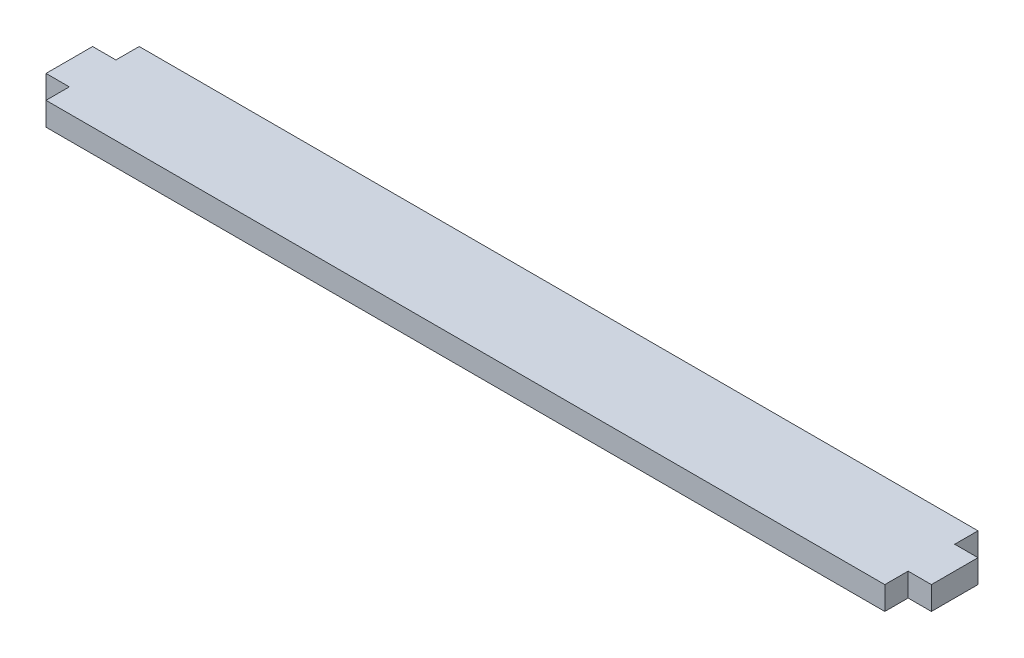
ISO-10303-21;
HEADER;
FILE_DESCRIPTION(('STEP AP214'),'2;1');
FILE_NAME('part.step','',(''),(''),'','','');
FILE_SCHEMA(('AUTOMOTIVE_DESIGN { 1 0 10303 214 1 1 1 1 }'));
ENDSEC;
DATA;
#1=APPLICATION_CONTEXT('core data for automotive mechanical design processes');
#2=APPLICATION_PROTOCOL_DEFINITION('international standard','automotive_design',2000,#1);
#3=PRODUCT_CONTEXT('',#1,'mechanical');
#4=PRODUCT('Part','Part','',(#3));
#5=PRODUCT_RELATED_PRODUCT_CATEGORY('part','',(#4));
#6=PRODUCT_DEFINITION_FORMATION('','',#4);
#7=PRODUCT_DEFINITION_CONTEXT('part definition',#1,'design');
#8=PRODUCT_DEFINITION('design','',#6,#7);
#9=PRODUCT_DEFINITION_SHAPE('','',#8);
#10=(LENGTH_UNIT() NAMED_UNIT(*) SI_UNIT(.MILLI.,.METRE.));
#11=(NAMED_UNIT(*) PLANE_ANGLE_UNIT() SI_UNIT($,.RADIAN.));
#12=(NAMED_UNIT(*) SI_UNIT($,.STERADIAN.) SOLID_ANGLE_UNIT());
#13=UNCERTAINTY_MEASURE_WITH_UNIT(LENGTH_MEASURE(1.E-05),#10,'distance_accuracy_value','');
#14=(GEOMETRIC_REPRESENTATION_CONTEXT(3) GLOBAL_UNCERTAINTY_ASSIGNED_CONTEXT((#13)) GLOBAL_UNIT_ASSIGNED_CONTEXT((#10,
#11,#12)) REPRESENTATION_CONTEXT('',''));
#15=CARTESIAN_POINT('',(0.,0.,0.));
#16=DIRECTION('',(0.,0.,1.));
#17=DIRECTION('',(1.,0.,0.));
#18=AXIS2_PLACEMENT_3D('',#15,#16,#17);
#19=CARTESIAN_POINT('',(0.,3.175,0.));
#20=DIRECTION('',(-1.,0.,0.));
#21=DIRECTION('',(0.,0.,1.));
#22=AXIS2_PLACEMENT_3D('',#19,#20,#21);
#23=PLANE('',#22);
#24=DIRECTION('',(0.,0.,-1.));
#25=VECTOR('',#24,1.);
#26=CARTESIAN_POINT('',(0.,0.,0.));
#27=LINE('',#26,#25);
#28=CARTESIAN_POINT('',(0.,0.,0.));
#29=VERTEX_POINT('',#28);
#30=CARTESIAN_POINT('',(0.,0.,-3.175));
#31=VERTEX_POINT('',#30);
#32=EDGE_CURVE('E152',#29,#31,#27,.T.);
#33=ORIENTED_EDGE('',*,*,#32,.T.);
#34=DIRECTION('',(0.,-1.,0.));
#35=VECTOR('',#34,1.);
#36=CARTESIAN_POINT('',(0.,3.175,-3.175));
#37=LINE('',#36,#35);
#38=CARTESIAN_POINT('',(0.,3.175,-3.175));
#39=VERTEX_POINT('',#38);
#40=EDGE_CURVE('E11',#39,#31,#37,.T.);
#41=ORIENTED_EDGE('',*,*,#40,.F.);
#42=DIRECTION('',(0.,0.,-1.));
#43=VECTOR('',#42,1.);
#44=CARTESIAN_POINT('',(0.,3.175,0.));
#45=LINE('',#44,#43);
#46=CARTESIAN_POINT('',(0.,3.175,0.));
#47=VERTEX_POINT('',#46);
#48=EDGE_CURVE('E174',#47,#39,#45,.T.);
#49=ORIENTED_EDGE('',*,*,#48,.F.);
#50=DIRECTION('',(0.,-1.,0.));
#51=VECTOR('',#50,1.);
#52=CARTESIAN_POINT('',(0.,3.175,0.));
#53=LINE('',#52,#51);
#54=EDGE_CURVE('E148',#47,#29,#53,.T.);
#55=ORIENTED_EDGE('',*,*,#54,.T.);
#56=EDGE_LOOP('',(#33,#41,#49,#55));
#57=FACE_BOUND('',#56,.T.);
#58=ADVANCED_FACE('F32',(#57),#23,.F.);
#59=CARTESIAN_POINT('',(0.,3.175,-3.175));
#60=DIRECTION('',(0.,0.,-1.));
#61=DIRECTION('',(-1.,0.,0.));
#62=AXIS2_PLACEMENT_3D('',#59,#60,#61);
#63=PLANE('',#62);
#64=DIRECTION('',(1.,0.,0.));
#65=VECTOR('',#64,1.);
#66=CARTESIAN_POINT('',(0.,0.,-3.175));
#67=LINE('',#66,#65);
#68=CARTESIAN_POINT('',(3.17500000000003,0.,-3.175));
#69=VERTEX_POINT('',#68);
#70=EDGE_CURVE('E155',#31,#69,#67,.T.);
#71=ORIENTED_EDGE('',*,*,#70,.T.);
#72=DIRECTION('',(0.,-1.,0.));
#73=VECTOR('',#72,1.);
#74=CARTESIAN_POINT('',(3.17500000000003,3.175,-3.175));
#75=LINE('',#74,#73);
#76=CARTESIAN_POINT('',(3.17500000000003,3.175,-3.175));
#77=VERTEX_POINT('',#76);
#78=EDGE_CURVE('E40',#77,#69,#75,.T.);
#79=ORIENTED_EDGE('',*,*,#78,.F.);
#80=DIRECTION('',(1.,0.,0.));
#81=VECTOR('',#80,1.);
#82=CARTESIAN_POINT('',(0.,3.175,-3.175));
#83=LINE('',#82,#81);
#84=EDGE_CURVE('E103',#39,#77,#83,.T.);
#85=ORIENTED_EDGE('',*,*,#84,.F.);
#86=ORIENTED_EDGE('',*,*,#40,.T.);
#87=EDGE_LOOP('',(#71,#79,#85,#86));
#88=FACE_BOUND('',#87,.T.);
#89=ADVANCED_FACE('F252',(#88),#63,.F.);
#90=CARTESIAN_POINT('',(3.17500000000003,3.175,-9.525));
#91=DIRECTION('',(-1.,0.,0.));
#92=DIRECTION('',(0.,0.,1.));
#93=AXIS2_PLACEMENT_3D('',#90,#91,#92);
#94=PLANE('',#93);
#95=DIRECTION('',(0.,0.,-1.));
#96=VECTOR('',#95,1.);
#97=CARTESIAN_POINT('',(3.17500000000003,0.,-9.525));
#98=LINE('',#97,#96);
#99=CARTESIAN_POINT('',(3.17500000000003,0.,-9.525));
#100=VERTEX_POINT('',#99);
#101=EDGE_CURVE('E157',#69,#100,#98,.T.);
#102=ORIENTED_EDGE('',*,*,#101,.T.);
#103=DIRECTION('',(0.,-1.,0.));
#104=VECTOR('',#103,1.);
#105=CARTESIAN_POINT('',(3.17500000000003,3.175,-9.525));
#106=LINE('',#105,#104);
#107=CARTESIAN_POINT('',(3.17500000000003,3.175,-9.525));
#108=VERTEX_POINT('',#107);
#109=EDGE_CURVE('E193',#108,#100,#106,.T.);
#110=ORIENTED_EDGE('',*,*,#109,.F.);
#111=DIRECTION('',(0.,0.,-1.));
#112=VECTOR('',#111,1.);
#113=CARTESIAN_POINT('',(3.17500000000003,3.175,-9.525));
#114=LINE('',#113,#112);
#115=EDGE_CURVE('E201',#77,#108,#114,.T.);
#116=ORIENTED_EDGE('',*,*,#115,.F.);
#117=ORIENTED_EDGE('',*,*,#78,.T.);
#118=EDGE_LOOP('',(#102,#110,#116,#117));
#119=FACE_BOUND('',#118,.T.);
#120=ADVANCED_FACE('F199',(#119),#94,.F.);
#121=CARTESIAN_POINT('',(0.,3.175,-9.525));
#122=DIRECTION('',(0.,0.,1.));
#123=DIRECTION('',(1.,0.,0.));
#124=AXIS2_PLACEMENT_3D('',#121,#122,#123);
#125=PLANE('',#124);
#126=DIRECTION('',(-1.,0.,0.));
#127=VECTOR('',#126,1.);
#128=CARTESIAN_POINT('',(0.,0.,-9.525));
#129=LINE('',#128,#127);
#130=CARTESIAN_POINT('',(0.,0.,-9.525));
#131=VERTEX_POINT('',#130);
#132=EDGE_CURVE('E159',#100,#131,#129,.T.);
#133=ORIENTED_EDGE('',*,*,#132,.T.);
#134=DIRECTION('',(0.,-1.,0.));
#135=VECTOR('',#134,1.);
#136=CARTESIAN_POINT('',(0.,3.175,-9.525));
#137=LINE('',#136,#135);
#138=CARTESIAN_POINT('',(0.,3.175,-9.525));
#139=VERTEX_POINT('',#138);
#140=EDGE_CURVE('E190',#139,#131,#137,.T.);
#141=ORIENTED_EDGE('',*,*,#140,.F.);
#142=DIRECTION('',(-1.,0.,0.));
#143=VECTOR('',#142,1.);
#144=CARTESIAN_POINT('',(0.,3.175,-9.525));
#145=LINE('',#144,#143);
#146=EDGE_CURVE('E219',#108,#139,#145,.T.);
#147=ORIENTED_EDGE('',*,*,#146,.F.);
#148=ORIENTED_EDGE('',*,*,#109,.T.);
#149=EDGE_LOOP('',(#133,#141,#147,#148));
#150=FACE_BOUND('',#149,.T.);
#151=ADVANCED_FACE('F210',(#150),#125,.F.);
#152=CARTESIAN_POINT('',(0.,3.175,-9.525));
#153=DIRECTION('',(-1.,0.,0.));
#154=DIRECTION('',(0.,0.,1.));
#155=AXIS2_PLACEMENT_3D('',#152,#153,#154);
#156=PLANE('',#155);
#157=DIRECTION('',(0.,0.,-1.));
#158=VECTOR('',#157,1.);
#159=CARTESIAN_POINT('',(0.,0.,-9.525));
#160=LINE('',#159,#158);
#161=CARTESIAN_POINT('',(0.,0.,-12.7));
#162=VERTEX_POINT('',#161);
#163=EDGE_CURVE('E161',#131,#162,#160,.T.);
#164=ORIENTED_EDGE('',*,*,#163,.T.);
#165=DIRECTION('',(0.,-1.,0.));
#166=VECTOR('',#165,1.);
#167=CARTESIAN_POINT('',(0.,3.175,-12.7));
#168=LINE('',#167,#166);
#169=CARTESIAN_POINT('',(0.,3.175,-12.7));
#170=VERTEX_POINT('',#169);
#171=EDGE_CURVE('E187',#170,#162,#168,.T.);
#172=ORIENTED_EDGE('',*,*,#171,.F.);
#173=DIRECTION('',(0.,0.,-1.));
#174=VECTOR('',#173,1.);
#175=CARTESIAN_POINT('',(0.,3.175,-9.525));
#176=LINE('',#175,#174);
#177=EDGE_CURVE('E216',#139,#170,#176,.T.);
#178=ORIENTED_EDGE('',*,*,#177,.F.);
#179=ORIENTED_EDGE('',*,*,#140,.T.);
#180=EDGE_LOOP('',(#164,#172,#178,#179));
#181=FACE_BOUND('',#180,.T.);
#182=ADVANCED_FACE('F214',(#181),#156,.F.);
#183=CARTESIAN_POINT('',(0.,3.175,-12.7));
#184=DIRECTION('',(0.,0.,1.));
#185=DIRECTION('',(1.,0.,0.));
#186=AXIS2_PLACEMENT_3D('',#183,#184,#185);
#187=PLANE('',#186);
#188=DIRECTION('',(-1.,0.,0.));
#189=VECTOR('',#188,1.);
#190=CARTESIAN_POINT('',(0.,0.,-12.7));
#191=LINE('',#190,#189);
#192=CARTESIAN_POINT('',(-114.3,0.,-12.7));
#193=VERTEX_POINT('',#192);
#194=EDGE_CURVE('E163',#162,#193,#191,.T.);
#195=ORIENTED_EDGE('',*,*,#194,.T.);
#196=DIRECTION('',(0.,-1.,0.));
#197=VECTOR('',#196,1.);
#198=CARTESIAN_POINT('',(-114.3,3.175,-12.7));
#199=LINE('',#198,#197);
#200=CARTESIAN_POINT('',(-114.3,3.175,-12.7));
#201=VERTEX_POINT('',#200);
#202=EDGE_CURVE('E184',#201,#193,#199,.T.);
#203=ORIENTED_EDGE('',*,*,#202,.F.);
#204=DIRECTION('',(-1.,0.,0.));
#205=VECTOR('',#204,1.);
#206=CARTESIAN_POINT('',(0.,3.175,-12.7));
#207=LINE('',#206,#205);
#208=EDGE_CURVE('E218',#170,#201,#207,.T.);
#209=ORIENTED_EDGE('',*,*,#208,.F.);
#210=ORIENTED_EDGE('',*,*,#171,.T.);
#211=EDGE_LOOP('',(#195,#203,#209,#210));
#212=FACE_BOUND('',#211,.T.);
#213=ADVANCED_FACE('F265',(#212),#187,.F.);
#214=CARTESIAN_POINT('',(-114.3,3.175,-9.525));
#215=DIRECTION('',(1.,0.,0.));
#216=DIRECTION('',(0.,0.,-1.));
#217=AXIS2_PLACEMENT_3D('',#214,#215,#216);
#218=PLANE('',#217);
#219=DIRECTION('',(0.,0.,1.));
#220=VECTOR('',#219,1.);
#221=CARTESIAN_POINT('',(-114.3,0.,-9.525));
#222=LINE('',#221,#220);
#223=CARTESIAN_POINT('',(-114.3,0.,-9.525));
#224=VERTEX_POINT('',#223);
#225=EDGE_CURVE('E165',#193,#224,#222,.T.);
#226=ORIENTED_EDGE('',*,*,#225,.T.);
#227=DIRECTION('',(0.,-1.,0.));
#228=VECTOR('',#227,1.);
#229=CARTESIAN_POINT('',(-114.3,3.175,-9.525));
#230=LINE('',#229,#228);
#231=CARTESIAN_POINT('',(-114.3,3.175,-9.525));
#232=VERTEX_POINT('',#231);
#233=EDGE_CURVE('E181',#232,#224,#230,.T.);
#234=ORIENTED_EDGE('',*,*,#233,.F.);
#235=DIRECTION('',(0.,0.,1.));
#236=VECTOR('',#235,1.);
#237=CARTESIAN_POINT('',(-114.3,3.175,-9.525));
#238=LINE('',#237,#236);
#239=EDGE_CURVE('E221',#201,#232,#238,.T.);
#240=ORIENTED_EDGE('',*,*,#239,.F.);
#241=ORIENTED_EDGE('',*,*,#202,.T.);
#242=EDGE_LOOP('',(#226,#234,#240,#241));
#243=FACE_BOUND('',#242,.T.);
#244=ADVANCED_FACE('F268',(#243),#218,.F.);
#245=CARTESIAN_POINT('',(-114.3,3.175,-9.525));
#246=DIRECTION('',(0.,0.,1.));
#247=DIRECTION('',(1.,0.,0.));
#248=AXIS2_PLACEMENT_3D('',#245,#246,#247);
#249=PLANE('',#248);
#250=DIRECTION('',(-1.,0.,0.));
#251=VECTOR('',#250,1.);
#252=CARTESIAN_POINT('',(-114.3,0.,-9.525));
#253=LINE('',#252,#251);
#254=CARTESIAN_POINT('',(-117.475,0.,-9.525));
#255=VERTEX_POINT('',#254);
#256=EDGE_CURVE('E167',#224,#255,#253,.T.);
#257=ORIENTED_EDGE('',*,*,#256,.T.);
#258=DIRECTION('',(0.,-1.,0.));
#259=VECTOR('',#258,1.);
#260=CARTESIAN_POINT('',(-117.475,3.175,-9.525));
#261=LINE('',#260,#259);
#262=CARTESIAN_POINT('',(-117.475,3.175,-9.525));
#263=VERTEX_POINT('',#262);
#264=EDGE_CURVE('E178',#263,#255,#261,.T.);
#265=ORIENTED_EDGE('',*,*,#264,.F.);
#266=DIRECTION('',(-1.,0.,0.));
#267=VECTOR('',#266,1.);
#268=CARTESIAN_POINT('',(-114.3,3.175,-9.525));
#269=LINE('',#268,#267);
#270=EDGE_CURVE('E227',#232,#263,#269,.T.);
#271=ORIENTED_EDGE('',*,*,#270,.F.);
#272=ORIENTED_EDGE('',*,*,#233,.T.);
#273=EDGE_LOOP('',(#257,#265,#271,#272));
#274=FACE_BOUND('',#273,.T.);
#275=ADVANCED_FACE('F233',(#274),#249,.F.);
#276=CARTESIAN_POINT('',(-117.475,3.175,-9.525));
#277=DIRECTION('',(1.,0.,0.));
#278=DIRECTION('',(0.,0.,-1.));
#279=AXIS2_PLACEMENT_3D('',#276,#277,#278);
#280=PLANE('',#279);
#281=DIRECTION('',(0.,0.,1.));
#282=VECTOR('',#281,1.);
#283=CARTESIAN_POINT('',(-117.475,0.,-9.525));
#284=LINE('',#283,#282);
#285=CARTESIAN_POINT('',(-117.475,0.,-3.175));
#286=VERTEX_POINT('',#285);
#287=EDGE_CURVE('E169',#255,#286,#284,.T.);
#288=ORIENTED_EDGE('',*,*,#287,.T.);
#289=DIRECTION('',(0.,-1.,0.));
#290=VECTOR('',#289,1.);
#291=CARTESIAN_POINT('',(-117.475,3.175,-3.175));
#292=LINE('',#291,#290);
#293=CARTESIAN_POINT('',(-117.475,3.175,-3.175));
#294=VERTEX_POINT('',#293);
#295=EDGE_CURVE('E143',#294,#286,#292,.T.);
#296=ORIENTED_EDGE('',*,*,#295,.F.);
#297=DIRECTION('',(0.,0.,1.));
#298=VECTOR('',#297,1.);
#299=CARTESIAN_POINT('',(-117.475,3.175,-9.525));
#300=LINE('',#299,#298);
#301=EDGE_CURVE('E134',#263,#294,#300,.T.);
#302=ORIENTED_EDGE('',*,*,#301,.F.);
#303=ORIENTED_EDGE('',*,*,#264,.T.);
#304=EDGE_LOOP('',(#288,#296,#302,#303));
#305=FACE_BOUND('',#304,.T.);
#306=ADVANCED_FACE('F237',(#305),#280,.F.);
#307=CARTESIAN_POINT('',(-114.3,3.175,-3.175));
#308=DIRECTION('',(0.,0.,-1.));
#309=DIRECTION('',(-1.,0.,0.));
#310=AXIS2_PLACEMENT_3D('',#307,#308,#309);
#311=PLANE('',#310);
#312=DIRECTION('',(1.,0.,0.));
#313=VECTOR('',#312,1.);
#314=CARTESIAN_POINT('',(-114.3,0.,-3.175));
#315=LINE('',#314,#313);
#316=CARTESIAN_POINT('',(-114.3,0.,-3.175));
#317=VERTEX_POINT('',#316);
#318=EDGE_CURVE('E142',#286,#317,#315,.T.);
#319=ORIENTED_EDGE('',*,*,#318,.T.);
#320=DIRECTION('',(0.,-1.,0.));
#321=VECTOR('',#320,1.);
#322=CARTESIAN_POINT('',(-114.3,3.175,-3.175));
#323=LINE('',#322,#321);
#324=CARTESIAN_POINT('',(-114.3,3.175,-3.175));
#325=VERTEX_POINT('',#324);
#326=EDGE_CURVE('E139',#325,#317,#323,.T.);
#327=ORIENTED_EDGE('',*,*,#326,.F.);
#328=DIRECTION('',(1.,0.,0.));
#329=VECTOR('',#328,1.);
#330=CARTESIAN_POINT('',(-114.3,3.175,-3.175));
#331=LINE('',#330,#329);
#332=EDGE_CURVE('E128',#294,#325,#331,.T.);
#333=ORIENTED_EDGE('',*,*,#332,.F.);
#334=ORIENTED_EDGE('',*,*,#295,.T.);
#335=EDGE_LOOP('',(#319,#327,#333,#334));
#336=FACE_BOUND('',#335,.T.);
#337=ADVANCED_FACE('F140',(#336),#311,.F.);
#338=CARTESIAN_POINT('',(-114.3,3.175,0.));
#339=DIRECTION('',(1.,0.,0.));
#340=DIRECTION('',(0.,0.,-1.));
#341=AXIS2_PLACEMENT_3D('',#338,#339,#340);
#342=PLANE('',#341);
#343=DIRECTION('',(0.,0.,1.));
#344=VECTOR('',#343,1.);
#345=CARTESIAN_POINT('',(-114.3,0.,0.));
#346=LINE('',#345,#344);
#347=CARTESIAN_POINT('',(-114.3,0.,0.));
#348=VERTEX_POINT('',#347);
#349=EDGE_CURVE('E89',#317,#348,#346,.T.);
#350=ORIENTED_EDGE('',*,*,#349,.T.);
#351=DIRECTION('',(0.,-1.,0.));
#352=VECTOR('',#351,1.);
#353=CARTESIAN_POINT('',(-114.3,3.175,0.));
#354=LINE('',#353,#352);
#355=CARTESIAN_POINT('',(-114.3,3.175,0.));
#356=VERTEX_POINT('',#355);
#357=EDGE_CURVE('E144',#356,#348,#354,.T.);
#358=ORIENTED_EDGE('',*,*,#357,.F.);
#359=DIRECTION('',(0.,0.,1.));
#360=VECTOR('',#359,1.);
#361=CARTESIAN_POINT('',(-114.3,3.175,0.));
#362=LINE('',#361,#360);
#363=EDGE_CURVE('E132',#325,#356,#362,.T.);
#364=ORIENTED_EDGE('',*,*,#363,.F.);
#365=ORIENTED_EDGE('',*,*,#326,.T.);
#366=EDGE_LOOP('',(#350,#358,#364,#365));
#367=FACE_BOUND('',#366,.T.);
#368=ADVANCED_FACE('F146',(#367),#342,.F.);
#369=CARTESIAN_POINT('',(0.,3.175,0.));
#370=DIRECTION('',(0.,0.,-1.));
#371=DIRECTION('',(-1.,0.,0.));
#372=AXIS2_PLACEMENT_3D('',#369,#370,#371);
#373=PLANE('',#372);
#374=DIRECTION('',(1.,0.,0.));
#375=VECTOR('',#374,1.);
#376=CARTESIAN_POINT('',(0.,0.,0.));
#377=LINE('',#376,#375);
#378=EDGE_CURVE('E95',#348,#29,#377,.T.);
#379=ORIENTED_EDGE('',*,*,#378,.T.);
#380=ORIENTED_EDGE('',*,*,#54,.F.);
#381=DIRECTION('',(1.,0.,0.));
#382=VECTOR('',#381,1.);
#383=CARTESIAN_POINT('',(0.,3.175,0.));
#384=LINE('',#383,#382);
#385=EDGE_CURVE('E48',#356,#47,#384,.T.);
#386=ORIENTED_EDGE('',*,*,#385,.F.);
#387=ORIENTED_EDGE('',*,*,#357,.T.);
#388=EDGE_LOOP('',(#379,#380,#386,#387));
#389=FACE_BOUND('',#388,.T.);
#390=ADVANCED_FACE('F241',(#389),#373,.F.);
#391=CARTESIAN_POINT('',(0.,3.175,0.));
#392=DIRECTION('',(0.,-1.,0.));
#393=DIRECTION('',(0.,0.,-1.));
#394=AXIS2_PLACEMENT_3D('',#391,#392,#393);
#395=PLANE('',#394);
#396=ORIENTED_EDGE('',*,*,#48,.T.);
#397=ORIENTED_EDGE('',*,*,#84,.T.);
#398=ORIENTED_EDGE('',*,*,#115,.T.);
#399=ORIENTED_EDGE('',*,*,#146,.T.);
#400=ORIENTED_EDGE('',*,*,#177,.T.);
#401=ORIENTED_EDGE('',*,*,#208,.T.);
#402=ORIENTED_EDGE('',*,*,#239,.T.);
#403=ORIENTED_EDGE('',*,*,#270,.T.);
#404=ORIENTED_EDGE('',*,*,#301,.T.);
#405=ORIENTED_EDGE('',*,*,#332,.T.);
#406=ORIENTED_EDGE('',*,*,#363,.T.);
#407=ORIENTED_EDGE('',*,*,#385,.T.);
#408=EDGE_LOOP('',(#396,#397,#398,#399,#400,#401,#402,#403,#404,#405,#406,#407));
#409=FACE_BOUND('',#408,.T.);
#410=ADVANCED_FACE('F130',(#409),#395,.F.);
#411=CARTESIAN_POINT('',(0.,0.,0.));
#412=DIRECTION('',(0.,-1.,0.));
#413=DIRECTION('',(0.,0.,-1.));
#414=AXIS2_PLACEMENT_3D('',#411,#412,#413);
#415=PLANE('',#414);
#416=ORIENTED_EDGE('',*,*,#32,.F.);
#417=ORIENTED_EDGE('',*,*,#378,.F.);
#418=ORIENTED_EDGE('',*,*,#349,.F.);
#419=ORIENTED_EDGE('',*,*,#318,.F.);
#420=ORIENTED_EDGE('',*,*,#287,.F.);
#421=ORIENTED_EDGE('',*,*,#256,.F.);
#422=ORIENTED_EDGE('',*,*,#225,.F.);
#423=ORIENTED_EDGE('',*,*,#194,.F.);
#424=ORIENTED_EDGE('',*,*,#163,.F.);
#425=ORIENTED_EDGE('',*,*,#132,.F.);
#426=ORIENTED_EDGE('',*,*,#101,.F.);
#427=ORIENTED_EDGE('',*,*,#70,.F.);
#428=EDGE_LOOP('',(#416,#417,#418,#419,#420,#421,#422,#423,#424,#425,#426,#427));
#429=FACE_BOUND('',#428,.T.);
#430=ADVANCED_FACE('F205',(#429),#415,.T.);
#431=CLOSED_SHELL('',(#58,#89,#120,#151,#182,#213,#244,#275,#306,#337,#368,#390,#410,#430));
#432=MANIFOLD_SOLID_BREP('B2',#431);
#433=ADVANCED_BREP_SHAPE_REPRESENTATION('',(#18,#432),#14);
#434=SHAPE_DEFINITION_REPRESENTATION(#9,#433);
ENDSEC;
END-ISO-10303-21;
